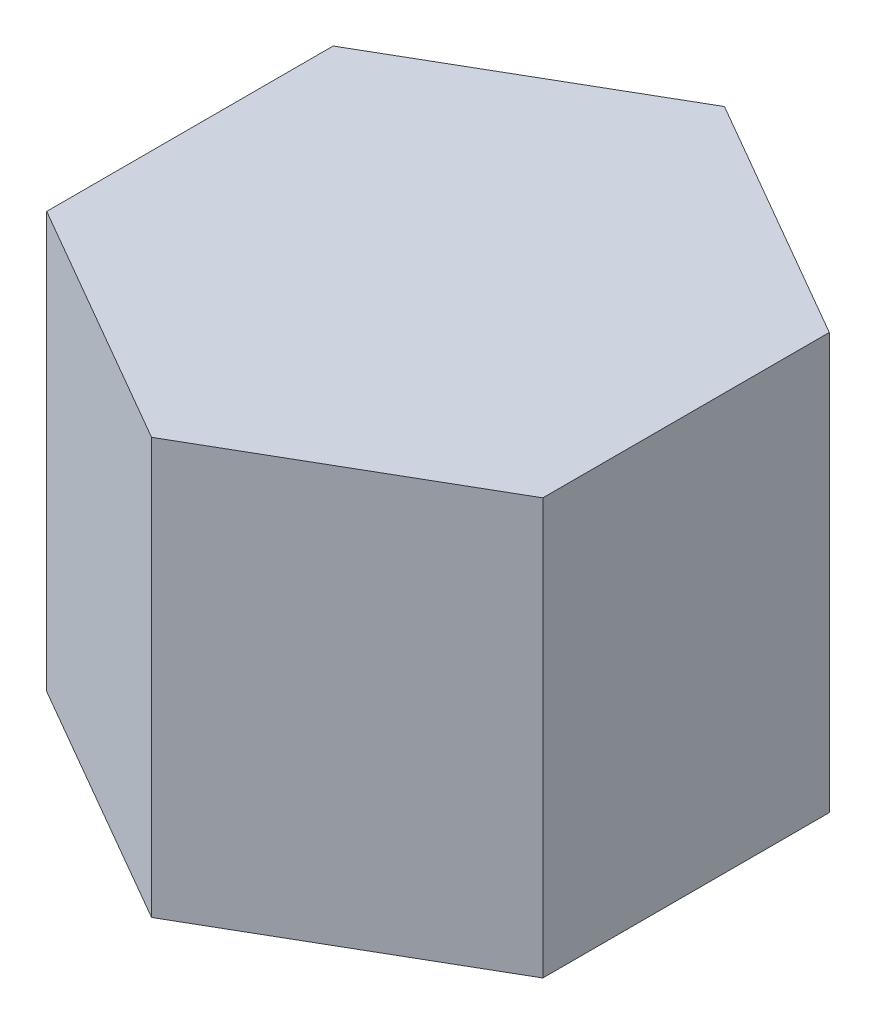
ISO-10303-21;
HEADER;
FILE_DESCRIPTION(('STEP AP214'),'2;1');
FILE_NAME('part.step','',(''),(''),'','','');
FILE_SCHEMA(('AUTOMOTIVE_DESIGN { 1 0 10303 214 1 1 1 1 }'));
ENDSEC;
DATA;
#1=APPLICATION_CONTEXT('core data for automotive mechanical design processes');
#2=APPLICATION_PROTOCOL_DEFINITION('international standard','automotive_design',2000,#1);
#3=PRODUCT_CONTEXT('',#1,'mechanical');
#4=PRODUCT('Part','Part','',(#3));
#5=PRODUCT_RELATED_PRODUCT_CATEGORY('part','',(#4));
#6=PRODUCT_DEFINITION_FORMATION('','',#4);
#7=PRODUCT_DEFINITION_CONTEXT('part definition',#1,'design');
#8=PRODUCT_DEFINITION('design','',#6,#7);
#9=PRODUCT_DEFINITION_SHAPE('','',#8);
#10=(LENGTH_UNIT() NAMED_UNIT(*) SI_UNIT(.MILLI.,.METRE.));
#11=(NAMED_UNIT(*) PLANE_ANGLE_UNIT() SI_UNIT($,.RADIAN.));
#12=(NAMED_UNIT(*) SI_UNIT($,.STERADIAN.) SOLID_ANGLE_UNIT());
#13=UNCERTAINTY_MEASURE_WITH_UNIT(LENGTH_MEASURE(1.E-05),#10,'distance_accuracy_value','');
#14=(GEOMETRIC_REPRESENTATION_CONTEXT(3) GLOBAL_UNCERTAINTY_ASSIGNED_CONTEXT((#13)) GLOBAL_UNIT_ASSIGNED_CONTEXT((#10,
#11,#12)) REPRESENTATION_CONTEXT('',''));
#15=CARTESIAN_POINT('',(0.,0.,0.));
#16=DIRECTION('',(0.,0.,1.));
#17=DIRECTION('',(1.,0.,0.));
#18=AXIS2_PLACEMENT_3D('',#15,#16,#17);
#19=CARTESIAN_POINT('',(207.642660308706,-148.537700895744,288.042869605357));
#20=DIRECTION('',(-0.499999999999943,0.,-0.866025403784472));
#21=DIRECTION('',(-0.866025403784472,0.,0.499999999999943));
#22=AXIS2_PLACEMENT_3D('',#19,#20,#21);
#23=PLANE('',#22);
#24=CARTESIAN_POINT('',(207.339551417382,-149.045793579175,288.217869605357));
#25=DIRECTION('',(0.866025403784471,0.,-0.499999999999943));
#26=VECTOR('',#25,1.);
#27=LINE('',#24,#26);
#28=CARTESIAN_POINT('',(207.339551417382,-149.045793579175,288.217869605357));
#29=VERTEX_POINT('',#28);
#30=CARTESIAN_POINT('',(207.642660308706,-149.045793579175,288.042869605357));
#31=VERTEX_POINT('',#30);
#32=EDGE_CURVE('E170',#29,#31,#27,.T.);
#33=ORIENTED_EDGE('',*,*,#32,.T.);
#34=CARTESIAN_POINT('',(207.642660308706,-148.537700895744,288.042869605357));
#35=DIRECTION('',(0.,-1.,0.));
#36=VECTOR('',#35,1.);
#37=LINE('',#34,#36);
#38=CARTESIAN_POINT('',(207.642660308706,-148.537700895744,288.042869605357));
#39=VERTEX_POINT('',#38);
#40=EDGE_CURVE('E35',#39,#31,#37,.T.);
#41=ORIENTED_EDGE('',*,*,#40,.F.);
#42=CARTESIAN_POINT('',(207.339551417382,-148.537700895744,288.217869605357));
#43=DIRECTION('',(0.866025403784471,0.,-0.499999999999943));
#44=VECTOR('',#43,1.);
#45=LINE('',#42,#44);
#46=CARTESIAN_POINT('',(207.339551417382,-148.537700895744,288.217869605357));
#47=VERTEX_POINT('',#46);
#48=EDGE_CURVE('E159',#47,#39,#45,.T.);
#49=ORIENTED_EDGE('',*,*,#48,.F.);
#50=CARTESIAN_POINT('',(207.339551417382,-148.537700895744,288.217869605357));
#51=DIRECTION('',(0.,-1.,0.));
#52=VECTOR('',#51,1.);
#53=LINE('',#50,#52);
#54=EDGE_CURVE('E10',#47,#29,#53,.T.);
#55=ORIENTED_EDGE('',*,*,#54,.T.);
#56=EDGE_LOOP('',(#33,#41,#49,#55));
#57=FACE_BOUND('',#56,.T.);
#58=ADVANCED_FACE('F16',(#57),#23,.F.);
#59=CARTESIAN_POINT('',(207.339551417382,-148.537700895744,288.217869605357));
#60=DIRECTION('',(0.499999999999978,0.,-0.866025403784452));
#61=DIRECTION('',(-0.866025403784452,0.,-0.499999999999978));
#62=AXIS2_PLACEMENT_3D('',#59,#60,#61);
#63=PLANE('',#62);
#64=CARTESIAN_POINT('',(207.036442526057,-149.045793579175,288.042869605357));
#65=DIRECTION('',(0.866025403784452,0.,0.499999999999978));
#66=VECTOR('',#65,1.);
#67=LINE('',#64,#66);
#68=CARTESIAN_POINT('',(207.036442526057,-149.045793579175,288.042869605357));
#69=VERTEX_POINT('',#68);
#70=EDGE_CURVE('E167',#69,#29,#67,.T.);
#71=ORIENTED_EDGE('',*,*,#70,.T.);
#72=ORIENTED_EDGE('',*,*,#54,.F.);
#73=CARTESIAN_POINT('',(207.036442526057,-148.537700895744,288.042869605357));
#74=DIRECTION('',(0.866025403784452,0.,0.499999999999978));
#75=VECTOR('',#74,1.);
#76=LINE('',#73,#75);
#77=CARTESIAN_POINT('',(207.036442526057,-148.537700895744,288.042869605357));
#78=VERTEX_POINT('',#77);
#79=EDGE_CURVE('E156',#78,#47,#76,.T.);
#80=ORIENTED_EDGE('',*,*,#79,.F.);
#81=CARTESIAN_POINT('',(207.036442526057,-148.537700895744,288.042869605357));
#82=DIRECTION('',(0.,-1.,0.));
#83=VECTOR('',#82,1.);
#84=LINE('',#81,#83);
#85=EDGE_CURVE('E27',#78,#69,#84,.T.);
#86=ORIENTED_EDGE('',*,*,#85,.T.);
#87=EDGE_LOOP('',(#71,#72,#80,#86));
#88=FACE_BOUND('',#87,.T.);
#89=ADVANCED_FACE('F189',(#88),#63,.F.);
#90=CARTESIAN_POINT('',(207.036442526057,-148.537700895744,290.831971220494));
#91=DIRECTION('',(1.,0.,0.));
#92=DIRECTION('',(0.,1.,0.));
#93=AXIS2_PLACEMENT_3D('',#90,#91,#92);
#94=PLANE('',#93);
#95=CARTESIAN_POINT('',(207.036442526057,-149.045793579175,287.692869605357));
#96=DIRECTION('',(0.,0.,1.));
#97=VECTOR('',#96,1.);
#98=LINE('',#95,#97);
#99=CARTESIAN_POINT('',(207.036442526057,-149.045793579175,287.692869605357));
#100=VERTEX_POINT('',#99);
#101=EDGE_CURVE('E163',#100,#69,#98,.T.);
#102=ORIENTED_EDGE('',*,*,#101,.T.);
#103=ORIENTED_EDGE('',*,*,#85,.F.);
#104=CARTESIAN_POINT('',(207.036442526057,-148.537700895744,287.692869605357));
#105=DIRECTION('',(0.,0.,1.));
#106=VECTOR('',#105,1.);
#107=LINE('',#104,#106);
#108=CARTESIAN_POINT('',(207.036442526057,-148.537700895744,287.692869605357));
#109=VERTEX_POINT('',#108);
#110=EDGE_CURVE('E106',#109,#78,#107,.T.);
#111=ORIENTED_EDGE('',*,*,#110,.F.);
#112=CARTESIAN_POINT('',(207.036442526057,-148.537700895744,287.692869605357));
#113=DIRECTION('',(0.,-1.,0.));
#114=VECTOR('',#113,1.);
#115=LINE('',#112,#114);
#116=EDGE_CURVE('E94',#109,#100,#115,.T.);
#117=ORIENTED_EDGE('',*,*,#116,.T.);
#118=EDGE_LOOP('',(#102,#103,#111,#117));
#119=FACE_BOUND('',#118,.T.);
#120=ADVANCED_FACE('F198',(#119),#94,.F.);
#121=CARTESIAN_POINT('',(207.036442526057,-148.537700895744,287.692869605357));
#122=DIRECTION('',(0.499999999999978,0.,0.866025403784452));
#123=DIRECTION('',(0.866025403784452,0.,-0.499999999999978));
#124=AXIS2_PLACEMENT_3D('',#121,#122,#123);
#125=PLANE('',#124);
#126=CARTESIAN_POINT('',(207.339551417382,-149.045793579175,287.517869605357));
#127=DIRECTION('',(-0.866025403784452,0.,0.499999999999978));
#128=VECTOR('',#127,1.);
#129=LINE('',#126,#128);
#130=CARTESIAN_POINT('',(207.339551417382,-149.045793579175,287.517869605357));
#131=VERTEX_POINT('',#130);
#132=EDGE_CURVE('E162',#131,#100,#129,.T.);
#133=ORIENTED_EDGE('',*,*,#132,.T.);
#134=ORIENTED_EDGE('',*,*,#116,.F.);
#135=CARTESIAN_POINT('',(207.339551417382,-148.537700895744,287.517869605357));
#136=DIRECTION('',(-0.866025403784452,0.,0.499999999999978));
#137=VECTOR('',#136,1.);
#138=LINE('',#135,#137);
#139=CARTESIAN_POINT('',(207.339551417382,-148.537700895744,287.517869605357));
#140=VERTEX_POINT('',#139);
#141=EDGE_CURVE('E98',#140,#109,#138,.T.);
#142=ORIENTED_EDGE('',*,*,#141,.F.);
#143=CARTESIAN_POINT('',(207.339551417382,-148.537700895744,287.517869605357));
#144=DIRECTION('',(0.,-1.,0.));
#145=VECTOR('',#144,1.);
#146=LINE('',#143,#145);
#147=EDGE_CURVE('E79',#140,#131,#146,.T.);
#148=ORIENTED_EDGE('',*,*,#147,.T.);
#149=EDGE_LOOP('',(#133,#134,#142,#148));
#150=FACE_BOUND('',#149,.T.);
#151=ADVANCED_FACE('F100',(#150),#125,.F.);
#152=CARTESIAN_POINT('',(207.339551417382,-148.537700895744,287.517869605357));
#153=DIRECTION('',(-0.499999999999943,0.,0.866025403784472));
#154=DIRECTION('',(0.866025403784472,0.,0.499999999999943));
#155=AXIS2_PLACEMENT_3D('',#152,#153,#154);
#156=PLANE('',#155);
#157=CARTESIAN_POINT('',(207.642660308706,-149.045793579175,287.692869605357));
#158=DIRECTION('',(-0.866025403784471,0.,-0.499999999999943));
#159=VECTOR('',#158,1.);
#160=LINE('',#157,#159);
#161=CARTESIAN_POINT('',(207.642660308706,-149.045793579175,287.692869605357));
#162=VERTEX_POINT('',#161);
#163=EDGE_CURVE('E88',#162,#131,#160,.T.);
#164=ORIENTED_EDGE('',*,*,#163,.T.);
#165=ORIENTED_EDGE('',*,*,#147,.F.);
#166=CARTESIAN_POINT('',(207.642660308706,-148.537700895744,287.692869605357));
#167=DIRECTION('',(-0.866025403784471,0.,-0.499999999999943));
#168=VECTOR('',#167,1.);
#169=LINE('',#166,#168);
#170=CARTESIAN_POINT('',(207.642660308706,-148.537700895744,287.692869605357));
#171=VERTEX_POINT('',#170);
#172=EDGE_CURVE('E84',#171,#140,#169,.T.);
#173=ORIENTED_EDGE('',*,*,#172,.F.);
#174=CARTESIAN_POINT('',(207.642660308706,-148.537700895744,287.692869605357));
#175=DIRECTION('',(0.,-1.,0.));
#176=VECTOR('',#175,1.);
#177=LINE('',#174,#176);
#178=EDGE_CURVE('E58',#171,#162,#177,.T.);
#179=ORIENTED_EDGE('',*,*,#178,.T.);
#180=EDGE_LOOP('',(#164,#165,#173,#179));
#181=FACE_BOUND('',#180,.T.);
#182=ADVANCED_FACE('F82',(#181),#156,.F.);
#183=CARTESIAN_POINT('',(207.642660308706,-148.537700895744,290.831971220494));
#184=DIRECTION('',(-1.,0.,0.));
#185=DIRECTION('',(0.,-1.,0.));
#186=AXIS2_PLACEMENT_3D('',#183,#184,#185);
#187=PLANE('',#186);
#188=CARTESIAN_POINT('',(207.642660308706,-149.045793579175,288.042869605357));
#189=DIRECTION('',(0.,0.,-1.));
#190=VECTOR('',#189,1.);
#191=LINE('',#188,#190);
#192=EDGE_CURVE('E160',#31,#162,#191,.T.);
#193=ORIENTED_EDGE('',*,*,#192,.T.);
#194=ORIENTED_EDGE('',*,*,#178,.F.);
#195=CARTESIAN_POINT('',(207.642660308706,-148.537700895744,288.042869605357));
#196=DIRECTION('',(0.,0.,-1.));
#197=VECTOR('',#196,1.);
#198=LINE('',#195,#197);
#199=EDGE_CURVE('E112',#39,#171,#198,.T.);
#200=ORIENTED_EDGE('',*,*,#199,.F.);
#201=ORIENTED_EDGE('',*,*,#40,.T.);
#202=EDGE_LOOP('',(#193,#194,#200,#201));
#203=FACE_BOUND('',#202,.T.);
#204=ADVANCED_FACE('F131',(#203),#187,.F.);
#205=CARTESIAN_POINT('',(206.339551417382,-148.537700895744,290.831971220494));
#206=DIRECTION('',(0.,-1.,0.));
#207=DIRECTION('',(1.,0.,0.));
#208=AXIS2_PLACEMENT_3D('',#205,#206,#207);
#209=PLANE('',#208);
#210=ORIENTED_EDGE('',*,*,#48,.T.);
#211=ORIENTED_EDGE('',*,*,#199,.T.);
#212=ORIENTED_EDGE('',*,*,#172,.T.);
#213=ORIENTED_EDGE('',*,*,#141,.T.);
#214=ORIENTED_EDGE('',*,*,#110,.T.);
#215=ORIENTED_EDGE('',*,*,#79,.T.);
#216=EDGE_LOOP('',(#210,#211,#212,#213,#214,#215));
#217=FACE_BOUND('',#216,.T.);
#218=ADVANCED_FACE('F111',(#217),#209,.F.);
#219=CARTESIAN_POINT('',(206.339551417382,-149.045793579175,290.831971220494));
#220=DIRECTION('',(0.,-1.,0.));
#221=DIRECTION('',(1.,0.,0.));
#222=AXIS2_PLACEMENT_3D('',#219,#220,#221);
#223=PLANE('',#222);
#224=ORIENTED_EDGE('',*,*,#32,.F.);
#225=ORIENTED_EDGE('',*,*,#70,.F.);
#226=ORIENTED_EDGE('',*,*,#101,.F.);
#227=ORIENTED_EDGE('',*,*,#132,.F.);
#228=ORIENTED_EDGE('',*,*,#163,.F.);
#229=ORIENTED_EDGE('',*,*,#192,.F.);
#230=EDGE_LOOP('',(#224,#225,#226,#227,#228,#229));
#231=FACE_BOUND('',#230,.T.);
#232=ADVANCED_FACE('F130',(#231),#223,.T.);
#233=CLOSED_SHELL('',(#58,#89,#120,#151,#182,#204,#218,#232));
#234=MANIFOLD_SOLID_BREP('B1',#233);
#235=ADVANCED_BREP_SHAPE_REPRESENTATION('',(#18,#234),#14);
#236=SHAPE_DEFINITION_REPRESENTATION(#9,#235);
ENDSEC;
END-ISO-10303-21;
